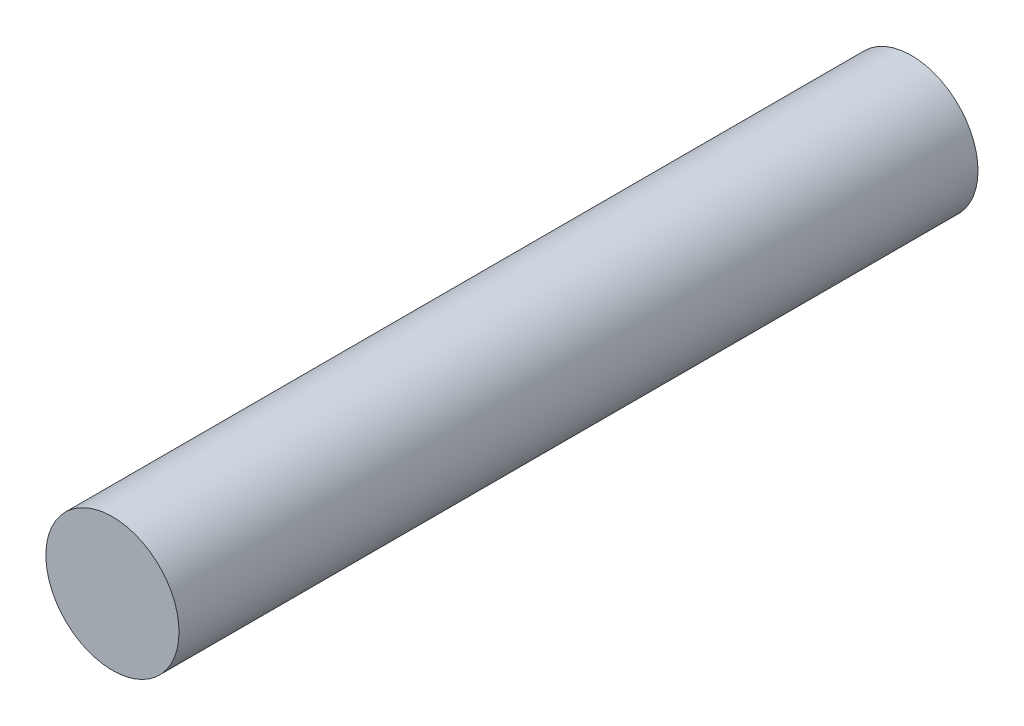
ISO-10303-21;
HEADER;
FILE_DESCRIPTION(('STEP AP214'),'2;1');
FILE_NAME('part.step','',(''),(''),'','','');
FILE_SCHEMA(('AUTOMOTIVE_DESIGN { 1 0 10303 214 1 1 1 1 }'));
ENDSEC;
DATA;
#1=APPLICATION_CONTEXT('core data for automotive mechanical design processes');
#2=APPLICATION_PROTOCOL_DEFINITION('international standard','automotive_design',2000,#1);
#3=PRODUCT_CONTEXT('',#1,'mechanical');
#4=PRODUCT('Part','Part','',(#3));
#5=PRODUCT_RELATED_PRODUCT_CATEGORY('part','',(#4));
#6=PRODUCT_DEFINITION_FORMATION('','',#4);
#7=PRODUCT_DEFINITION_CONTEXT('part definition',#1,'design');
#8=PRODUCT_DEFINITION('design','',#6,#7);
#9=PRODUCT_DEFINITION_SHAPE('','',#8);
#10=(LENGTH_UNIT() NAMED_UNIT(*) SI_UNIT(.MILLI.,.METRE.));
#11=(NAMED_UNIT(*) PLANE_ANGLE_UNIT() SI_UNIT($,.RADIAN.));
#12=(NAMED_UNIT(*) SI_UNIT($,.STERADIAN.) SOLID_ANGLE_UNIT());
#13=UNCERTAINTY_MEASURE_WITH_UNIT(LENGTH_MEASURE(1.E-05),#10,'distance_accuracy_value','');
#14=(GEOMETRIC_REPRESENTATION_CONTEXT(3) GLOBAL_UNCERTAINTY_ASSIGNED_CONTEXT((#13)) GLOBAL_UNIT_ASSIGNED_CONTEXT((#10,
#11,#12)) REPRESENTATION_CONTEXT('',''));
#15=CARTESIAN_POINT('',(0.,0.,0.));
#16=DIRECTION('',(0.,0.,1.));
#17=DIRECTION('',(1.,0.,0.));
#18=AXIS2_PLACEMENT_3D('',#15,#16,#17);
#19=CARTESIAN_POINT('',(0.,0.,15.));
#20=DIRECTION('',(0.,0.,-1.));
#21=DIRECTION('',(-1.,0.,0.));
#22=AXIS2_PLACEMENT_3D('',#19,#20,#21);
#23=CYLINDRICAL_SURFACE('',#22,2.5);
#24=CARTESIAN_POINT('',(0.,0.,15.));
#25=DIRECTION('',(0.,0.,1.));
#26=DIRECTION('',(1.,0.,0.));
#27=AXIS2_PLACEMENT_3D('',#24,#25,#26);
#28=CIRCLE('',#27,2.5);
#29=CARTESIAN_POINT('',(2.5,0.,15.));
#30=VERTEX_POINT('',#29);
#31=EDGE_CURVE('E10',#30,#30,#28,.T.);
#32=ORIENTED_EDGE('',*,*,#31,.F.);
#33=EDGE_LOOP('',(#32));
#34=FACE_BOUND('',#33,.T.);
#35=CARTESIAN_POINT('',(0.,0.,-15.));
#36=DIRECTION('',(0.,0.,1.));
#37=DIRECTION('',(1.,0.,0.));
#38=AXIS2_PLACEMENT_3D('',#35,#36,#37);
#39=CIRCLE('',#38,2.5);
#40=CARTESIAN_POINT('',(2.5,0.,-15.));
#41=VERTEX_POINT('',#40);
#42=EDGE_CURVE('E44',#41,#41,#39,.T.);
#43=ORIENTED_EDGE('',*,*,#42,.T.);
#44=EDGE_LOOP('',(#43));
#45=FACE_BOUND('',#44,.T.);
#46=ADVANCED_FACE('F41',(#34,#45),#23,.T.);
#47=CARTESIAN_POINT('',(0.,0.,15.));
#48=DIRECTION('',(0.,0.,1.));
#49=DIRECTION('',(1.,0.,0.));
#50=AXIS2_PLACEMENT_3D('',#47,#48,#49);
#51=PLANE('',#50);
#52=ORIENTED_EDGE('',*,*,#31,.T.);
#53=EDGE_LOOP('',(#52));
#54=FACE_BOUND('',#53,.T.);
#55=ADVANCED_FACE('F58',(#54),#51,.T.);
#56=CARTESIAN_POINT('',(0.,0.,-15.));
#57=DIRECTION('',(0.,0.,1.));
#58=DIRECTION('',(1.,0.,0.));
#59=AXIS2_PLACEMENT_3D('',#56,#57,#58);
#60=PLANE('',#59);
#61=ORIENTED_EDGE('',*,*,#42,.F.);
#62=EDGE_LOOP('',(#61));
#63=FACE_BOUND('',#62,.T.);
#64=ADVANCED_FACE('F56',(#63),#60,.F.);
#65=CLOSED_SHELL('',(#46,#55,#64));
#66=MANIFOLD_SOLID_BREP('B2',#65);
#67=ADVANCED_BREP_SHAPE_REPRESENTATION('',(#18,#66),#14);
#68=SHAPE_DEFINITION_REPRESENTATION(#9,#67);
ENDSEC;
END-ISO-10303-21;
